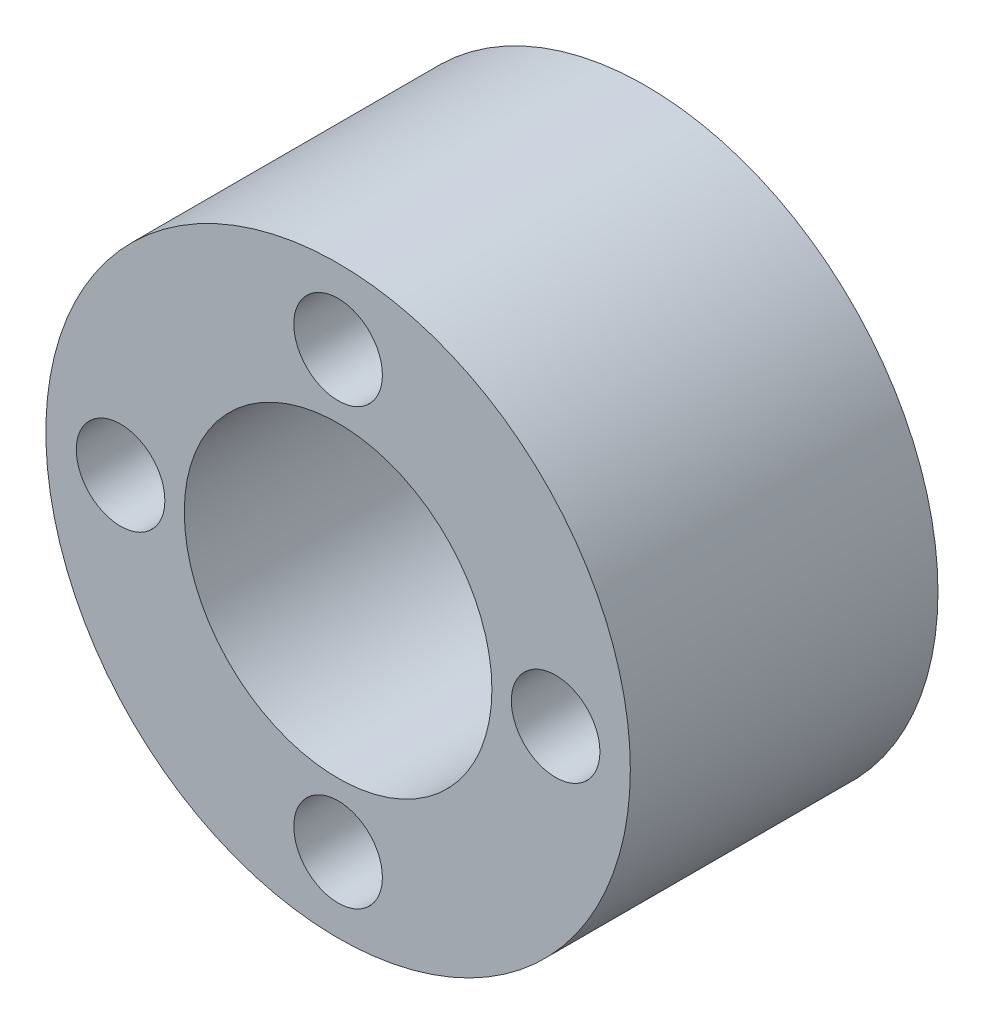
ISO-10303-21;
HEADER;
FILE_DESCRIPTION(('STEP AP214'),'2;1');
FILE_NAME('part.step','',(''),(''),'','','');
FILE_SCHEMA(('AUTOMOTIVE_DESIGN { 1 0 10303 214 1 1 1 1 }'));
ENDSEC;
DATA;
#1=APPLICATION_CONTEXT('core data for automotive mechanical design processes');
#2=APPLICATION_PROTOCOL_DEFINITION('international standard','automotive_design',2000,#1);
#3=PRODUCT_CONTEXT('',#1,'mechanical');
#4=PRODUCT('Part','Part','',(#3));
#5=PRODUCT_RELATED_PRODUCT_CATEGORY('part','',(#4));
#6=PRODUCT_DEFINITION_FORMATION('','',#4);
#7=PRODUCT_DEFINITION_CONTEXT('part definition',#1,'design');
#8=PRODUCT_DEFINITION('design','',#6,#7);
#9=PRODUCT_DEFINITION_SHAPE('','',#8);
#10=(LENGTH_UNIT() NAMED_UNIT(*) SI_UNIT(.MILLI.,.METRE.));
#11=(NAMED_UNIT(*) PLANE_ANGLE_UNIT() SI_UNIT($,.RADIAN.));
#12=(NAMED_UNIT(*) SI_UNIT($,.STERADIAN.) SOLID_ANGLE_UNIT());
#13=UNCERTAINTY_MEASURE_WITH_UNIT(LENGTH_MEASURE(1.E-05),#10,'distance_accuracy_value','');
#14=(GEOMETRIC_REPRESENTATION_CONTEXT(3) GLOBAL_UNCERTAINTY_ASSIGNED_CONTEXT((#13)) GLOBAL_UNIT_ASSIGNED_CONTEXT((#10,
#11,#12)) REPRESENTATION_CONTEXT('',''));
#15=CARTESIAN_POINT('',(0.,0.,0.));
#16=DIRECTION('',(0.,0.,1.));
#17=DIRECTION('',(1.,0.,0.));
#18=AXIS2_PLACEMENT_3D('',#15,#16,#17);
#19=CARTESIAN_POINT('',(0.,0.,12.7));
#20=DIRECTION('',(0.,0.,1.));
#21=DIRECTION('',(1.,0.,0.));
#22=AXIS2_PLACEMENT_3D('',#19,#20,#21);
#23=PLANE('',#22);
#24=CARTESIAN_POINT('',(0.,8.98025612106915,12.7));
#25=DIRECTION('',(0.,0.,1.));
#26=DIRECTION('',(1.,0.,0.));
#27=AXIS2_PLACEMENT_3D('',#24,#25,#26);
#28=CIRCLE('',#27,1.8288);
#29=CARTESIAN_POINT('',(1.8288,8.98025612106915,12.7));
#30=VERTEX_POINT('',#29);
#31=EDGE_CURVE('E58',#30,#30,#28,.T.);
#32=ORIENTED_EDGE('',*,*,#31,.F.);
#33=EDGE_LOOP('',(#32));
#34=FACE_BOUND('',#33,.T.);
#35=CARTESIAN_POINT('',(-8.98025612106915,0.,12.7));
#36=DIRECTION('',(0.,0.,1.));
#37=DIRECTION('',(1.,0.,0.));
#38=AXIS2_PLACEMENT_3D('',#35,#36,#37);
#39=CIRCLE('',#38,1.8288);
#40=CARTESIAN_POINT('',(-7.15145612106916,0.,12.7));
#41=VERTEX_POINT('',#40);
#42=EDGE_CURVE('E46',#41,#41,#39,.T.);
#43=ORIENTED_EDGE('',*,*,#42,.F.);
#44=EDGE_LOOP('',(#43));
#45=FACE_BOUND('',#44,.T.);
#46=CARTESIAN_POINT('',(0.,0.,12.7));
#47=DIRECTION('',(0.,0.,1.));
#48=DIRECTION('',(1.,0.,0.));
#49=AXIS2_PLACEMENT_3D('',#46,#47,#48);
#50=CIRCLE('',#49,12.065);
#51=CARTESIAN_POINT('',(12.065,0.,12.7));
#52=VERTEX_POINT('',#51);
#53=EDGE_CURVE('E10',#52,#52,#50,.T.);
#54=ORIENTED_EDGE('',*,*,#53,.T.);
#55=EDGE_LOOP('',(#54));
#56=FACE_BOUND('',#55,.T.);
#57=CARTESIAN_POINT('',(0.,0.,12.7));
#58=DIRECTION('',(0.,0.,1.));
#59=DIRECTION('',(1.,0.,0.));
#60=AXIS2_PLACEMENT_3D('',#57,#58,#59);
#61=CIRCLE('',#60,6.35);
#62=CARTESIAN_POINT('',(6.35,0.,12.7));
#63=VERTEX_POINT('',#62);
#64=EDGE_CURVE('E41',#63,#63,#61,.T.);
#65=ORIENTED_EDGE('',*,*,#64,.F.);
#66=EDGE_LOOP('',(#65));
#67=FACE_BOUND('',#66,.T.);
#68=CARTESIAN_POINT('',(8.98025612106915,0.,12.7));
#69=DIRECTION('',(0.,0.,1.));
#70=DIRECTION('',(1.,0.,0.));
#71=AXIS2_PLACEMENT_3D('',#68,#69,#70);
#72=CIRCLE('',#71,1.82880000000001);
#73=CARTESIAN_POINT('',(10.8090561210692,0.,12.7));
#74=VERTEX_POINT('',#73);
#75=EDGE_CURVE('E52',#74,#74,#72,.T.);
#76=ORIENTED_EDGE('',*,*,#75,.F.);
#77=EDGE_LOOP('',(#76));
#78=FACE_BOUND('',#77,.T.);
#79=CARTESIAN_POINT('',(0.,-8.98025612106915,12.7));
#80=DIRECTION('',(0.,0.,1.));
#81=DIRECTION('',(1.,0.,0.));
#82=AXIS2_PLACEMENT_3D('',#79,#80,#81);
#83=CIRCLE('',#82,1.8288);
#84=CARTESIAN_POINT('',(1.8288,-8.98025612106915,12.7));
#85=VERTEX_POINT('',#84);
#86=EDGE_CURVE('E64',#85,#85,#83,.T.);
#87=ORIENTED_EDGE('',*,*,#86,.F.);
#88=EDGE_LOOP('',(#87));
#89=FACE_BOUND('',#88,.T.);
#90=ADVANCED_FACE('F30',(#34,#45,#56,#67,#78,#89),#23,.T.);
#91=CARTESIAN_POINT('',(0.,0.,0.));
#92=DIRECTION('',(0.,0.,1.));
#93=DIRECTION('',(1.,0.,0.));
#94=AXIS2_PLACEMENT_3D('',#91,#92,#93);
#95=PLANE('',#94);
#96=CARTESIAN_POINT('',(0.,0.,0.));
#97=DIRECTION('',(0.,0.,1.));
#98=DIRECTION('',(1.,0.,0.));
#99=AXIS2_PLACEMENT_3D('',#96,#97,#98);
#100=CIRCLE('',#99,12.065);
#101=CARTESIAN_POINT('',(12.065,0.,0.));
#102=VERTEX_POINT('',#101);
#103=EDGE_CURVE('E34',#102,#102,#100,.T.);
#104=ORIENTED_EDGE('',*,*,#103,.F.);
#105=EDGE_LOOP('',(#104));
#106=FACE_BOUND('',#105,.T.);
#107=CARTESIAN_POINT('',(0.,0.,0.));
#108=DIRECTION('',(0.,0.,1.));
#109=DIRECTION('',(1.,0.,0.));
#110=AXIS2_PLACEMENT_3D('',#107,#108,#109);
#111=CIRCLE('',#110,6.35);
#112=CARTESIAN_POINT('',(6.35,0.,0.));
#113=VERTEX_POINT('',#112);
#114=EDGE_CURVE('E43',#113,#113,#111,.T.);
#115=ORIENTED_EDGE('',*,*,#114,.T.);
#116=EDGE_LOOP('',(#115));
#117=FACE_BOUND('',#116,.T.);
#118=CARTESIAN_POINT('',(-8.98025612106915,0.,0.));
#119=DIRECTION('',(0.,0.,1.));
#120=DIRECTION('',(1.,0.,0.));
#121=AXIS2_PLACEMENT_3D('',#118,#119,#120);
#122=CIRCLE('',#121,1.8288);
#123=CARTESIAN_POINT('',(-7.15145612106916,0.,0.));
#124=VERTEX_POINT('',#123);
#125=EDGE_CURVE('E49',#124,#124,#122,.T.);
#126=ORIENTED_EDGE('',*,*,#125,.T.);
#127=EDGE_LOOP('',(#126));
#128=FACE_BOUND('',#127,.T.);
#129=CARTESIAN_POINT('',(8.98025612106915,0.,0.));
#130=DIRECTION('',(0.,0.,1.));
#131=DIRECTION('',(1.,0.,0.));
#132=AXIS2_PLACEMENT_3D('',#129,#130,#131);
#133=CIRCLE('',#132,1.82880000000001);
#134=CARTESIAN_POINT('',(10.8090561210692,0.,0.));
#135=VERTEX_POINT('',#134);
#136=EDGE_CURVE('E55',#135,#135,#133,.T.);
#137=ORIENTED_EDGE('',*,*,#136,.T.);
#138=EDGE_LOOP('',(#137));
#139=FACE_BOUND('',#138,.T.);
#140=CARTESIAN_POINT('',(0.,8.98025612106915,0.));
#141=DIRECTION('',(0.,0.,1.));
#142=DIRECTION('',(1.,0.,0.));
#143=AXIS2_PLACEMENT_3D('',#140,#141,#142);
#144=CIRCLE('',#143,1.8288);
#145=CARTESIAN_POINT('',(1.8288,8.98025612106915,0.));
#146=VERTEX_POINT('',#145);
#147=EDGE_CURVE('E61',#146,#146,#144,.T.);
#148=ORIENTED_EDGE('',*,*,#147,.T.);
#149=EDGE_LOOP('',(#148));
#150=FACE_BOUND('',#149,.T.);
#151=CARTESIAN_POINT('',(0.,-8.98025612106915,0.));
#152=DIRECTION('',(0.,0.,1.));
#153=DIRECTION('',(1.,0.,0.));
#154=AXIS2_PLACEMENT_3D('',#151,#152,#153);
#155=CIRCLE('',#154,1.8288);
#156=CARTESIAN_POINT('',(1.8288,-8.98025612106915,0.));
#157=VERTEX_POINT('',#156);
#158=EDGE_CURVE('E67',#157,#157,#155,.T.);
#159=ORIENTED_EDGE('',*,*,#158,.T.);
#160=EDGE_LOOP('',(#159));
#161=FACE_BOUND('',#160,.T.);
#162=ADVANCED_FACE('F77',(#106,#117,#128,#139,#150,#161),#95,.F.);
#163=CARTESIAN_POINT('',(0.,0.,12.7));
#164=DIRECTION('',(0.,0.,-1.));
#165=DIRECTION('',(-1.,0.,0.));
#166=AXIS2_PLACEMENT_3D('',#163,#164,#165);
#167=CYLINDRICAL_SURFACE('',#166,12.065);
#168=ORIENTED_EDGE('',*,*,#53,.F.);
#169=EDGE_LOOP('',(#168));
#170=FACE_BOUND('',#169,.T.);
#171=ORIENTED_EDGE('',*,*,#103,.T.);
#172=EDGE_LOOP('',(#171));
#173=FACE_BOUND('',#172,.T.);
#174=ADVANCED_FACE('F32',(#170,#173),#167,.T.);
#175=CARTESIAN_POINT('',(0.,0.,12.7));
#176=DIRECTION('',(0.,0.,-1.));
#177=DIRECTION('',(-1.,0.,0.));
#178=AXIS2_PLACEMENT_3D('',#175,#176,#177);
#179=CYLINDRICAL_SURFACE('',#178,6.35);
#180=ORIENTED_EDGE('',*,*,#64,.T.);
#181=EDGE_LOOP('',(#180));
#182=FACE_BOUND('',#181,.T.);
#183=ORIENTED_EDGE('',*,*,#114,.F.);
#184=EDGE_LOOP('',(#183));
#185=FACE_BOUND('',#184,.T.);
#186=ADVANCED_FACE('F87',(#182,#185),#179,.F.);
#187=CARTESIAN_POINT('',(-8.98025612106915,0.,12.7));
#188=DIRECTION('',(0.,0.,-1.));
#189=DIRECTION('',(-1.,0.,0.));
#190=AXIS2_PLACEMENT_3D('',#187,#188,#189);
#191=CYLINDRICAL_SURFACE('',#190,1.8288);
#192=ORIENTED_EDGE('',*,*,#42,.T.);
#193=EDGE_LOOP('',(#192));
#194=FACE_BOUND('',#193,.T.);
#195=ORIENTED_EDGE('',*,*,#125,.F.);
#196=EDGE_LOOP('',(#195));
#197=FACE_BOUND('',#196,.T.);
#198=ADVANCED_FACE('F90',(#194,#197),#191,.F.);
#199=CARTESIAN_POINT('',(8.98025612106915,0.,12.7));
#200=DIRECTION('',(0.,0.,-1.));
#201=DIRECTION('',(-1.,0.,0.));
#202=AXIS2_PLACEMENT_3D('',#199,#200,#201);
#203=CYLINDRICAL_SURFACE('',#202,1.82880000000001);
#204=ORIENTED_EDGE('',*,*,#75,.T.);
#205=EDGE_LOOP('',(#204));
#206=FACE_BOUND('',#205,.T.);
#207=ORIENTED_EDGE('',*,*,#136,.F.);
#208=EDGE_LOOP('',(#207));
#209=FACE_BOUND('',#208,.T.);
#210=ADVANCED_FACE('F94',(#206,#209),#203,.F.);
#211=CARTESIAN_POINT('',(0.,8.98025612106915,12.7));
#212=DIRECTION('',(0.,0.,-1.));
#213=DIRECTION('',(-1.,0.,0.));
#214=AXIS2_PLACEMENT_3D('',#211,#212,#213);
#215=CYLINDRICAL_SURFACE('',#214,1.8288);
#216=ORIENTED_EDGE('',*,*,#31,.T.);
#217=EDGE_LOOP('',(#216));
#218=FACE_BOUND('',#217,.T.);
#219=ORIENTED_EDGE('',*,*,#147,.F.);
#220=EDGE_LOOP('',(#219));
#221=FACE_BOUND('',#220,.T.);
#222=ADVANCED_FACE('F98',(#218,#221),#215,.F.);
#223=CARTESIAN_POINT('',(0.,-8.98025612106915,12.7));
#224=DIRECTION('',(0.,0.,-1.));
#225=DIRECTION('',(-1.,0.,0.));
#226=AXIS2_PLACEMENT_3D('',#223,#224,#225);
#227=CYLINDRICAL_SURFACE('',#226,1.8288);
#228=ORIENTED_EDGE('',*,*,#86,.T.);
#229=EDGE_LOOP('',(#228));
#230=FACE_BOUND('',#229,.T.);
#231=ORIENTED_EDGE('',*,*,#158,.F.);
#232=EDGE_LOOP('',(#231));
#233=FACE_BOUND('',#232,.T.);
#234=ADVANCED_FACE('F73',(#230,#233),#227,.F.);
#235=CLOSED_SHELL('',(#90,#162,#174,#186,#198,#210,#222,#234));
#236=MANIFOLD_SOLID_BREP('B2',#235);
#237=ADVANCED_BREP_SHAPE_REPRESENTATION('',(#18,#236),#14);
#238=SHAPE_DEFINITION_REPRESENTATION(#9,#237);
ENDSEC;
END-ISO-10303-21;
